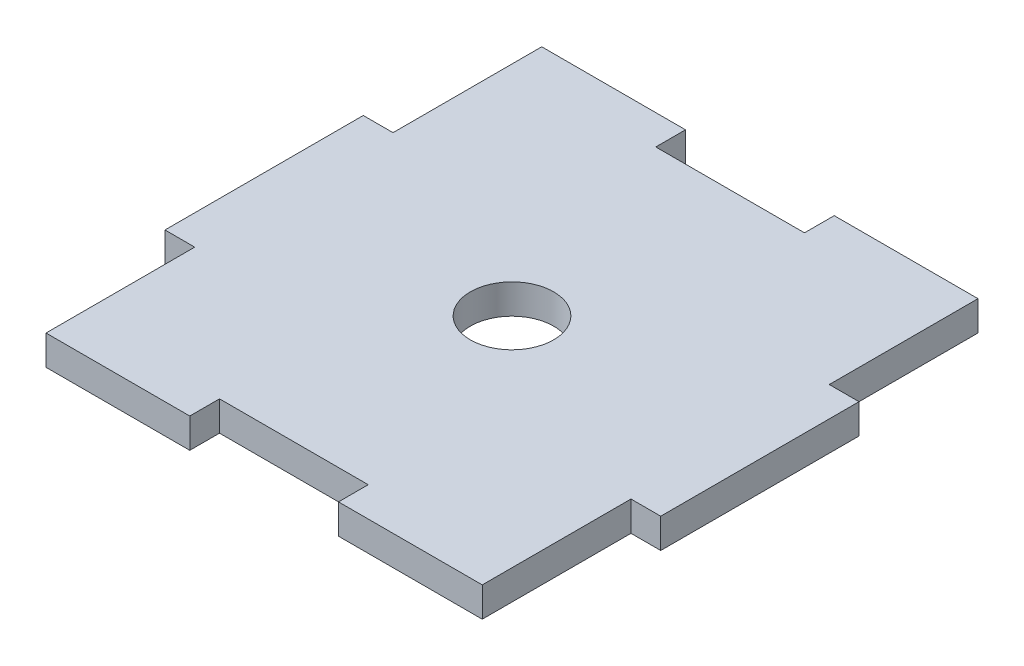
ISO-10303-21;
HEADER;
FILE_DESCRIPTION(('STEP AP214'),'2;1');
FILE_NAME('part.step','',(''),(''),'','','');
FILE_SCHEMA(('AUTOMOTIVE_DESIGN { 1 0 10303 214 1 1 1 1 }'));
ENDSEC;
DATA;
#1=APPLICATION_CONTEXT('core data for automotive mechanical design processes');
#2=APPLICATION_PROTOCOL_DEFINITION('international standard','automotive_design',2000,#1);
#3=PRODUCT_CONTEXT('',#1,'mechanical');
#4=PRODUCT('Part','Part','',(#3));
#5=PRODUCT_RELATED_PRODUCT_CATEGORY('part','',(#4));
#6=PRODUCT_DEFINITION_FORMATION('','',#4);
#7=PRODUCT_DEFINITION_CONTEXT('part definition',#1,'design');
#8=PRODUCT_DEFINITION('design','',#6,#7);
#9=PRODUCT_DEFINITION_SHAPE('','',#8);
#10=(LENGTH_UNIT() NAMED_UNIT(*) SI_UNIT(.MILLI.,.METRE.));
#11=(NAMED_UNIT(*) PLANE_ANGLE_UNIT() SI_UNIT($,.RADIAN.));
#12=(NAMED_UNIT(*) SI_UNIT($,.STERADIAN.) SOLID_ANGLE_UNIT());
#13=UNCERTAINTY_MEASURE_WITH_UNIT(LENGTH_MEASURE(1.E-05),#10,'distance_accuracy_value','');
#14=(GEOMETRIC_REPRESENTATION_CONTEXT(3) GLOBAL_UNCERTAINTY_ASSIGNED_CONTEXT((#13)) GLOBAL_UNIT_ASSIGNED_CONTEXT((#10,
#11,#12)) REPRESENTATION_CONTEXT('',''));
#15=CARTESIAN_POINT('',(0.,0.,0.));
#16=DIRECTION('',(0.,0.,1.));
#17=DIRECTION('',(1.,0.,0.));
#18=AXIS2_PLACEMENT_3D('',#15,#16,#17);
#19=CARTESIAN_POINT('',(0.,3.,0.));
#20=DIRECTION('',(0.,1.,0.));
#21=DIRECTION('',(0.,0.,1.));
#22=AXIS2_PLACEMENT_3D('',#19,#20,#21);
#23=PLANE('',#22);
#24=DIRECTION('',(-1.,0.,0.));
#25=VECTOR('',#24,1.);
#26=CARTESIAN_POINT('',(22.,3.,-25.));
#27=LINE('',#26,#25);
#28=CARTESIAN_POINT('',(22.,3.,-25.));
#29=VERTEX_POINT('',#28);
#30=CARTESIAN_POINT('',(7.5,3.,-25.));
#31=VERTEX_POINT('',#30);
#32=EDGE_CURVE('E243',#29,#31,#27,.T.);
#33=ORIENTED_EDGE('',*,*,#32,.T.);
#34=DIRECTION('',(0.,0.,1.));
#35=VECTOR('',#34,1.);
#36=CARTESIAN_POINT('',(7.5,3.,-25.));
#37=LINE('',#36,#35);
#38=CARTESIAN_POINT('',(7.5,3.,-22.));
#39=VERTEX_POINT('',#38);
#40=EDGE_CURVE('E131',#31,#39,#37,.T.);
#41=ORIENTED_EDGE('',*,*,#40,.T.);
#42=DIRECTION('',(-1.,0.,0.));
#43=VECTOR('',#42,1.);
#44=CARTESIAN_POINT('',(7.5,3.,-22.));
#45=LINE('',#44,#43);
#46=CARTESIAN_POINT('',(-7.5,3.,-22.));
#47=VERTEX_POINT('',#46);
#48=EDGE_CURVE('E294',#39,#47,#45,.T.);
#49=ORIENTED_EDGE('',*,*,#48,.T.);
#50=DIRECTION('',(0.,0.,-1.));
#51=VECTOR('',#50,1.);
#52=CARTESIAN_POINT('',(-7.5,3.,-25.));
#53=LINE('',#52,#51);
#54=CARTESIAN_POINT('',(-7.5,3.,-25.));
#55=VERTEX_POINT('',#54);
#56=EDGE_CURVE('E313',#47,#55,#53,.T.);
#57=ORIENTED_EDGE('',*,*,#56,.T.);
#58=DIRECTION('',(-1.,0.,0.));
#59=VECTOR('',#58,1.);
#60=CARTESIAN_POINT('',(-22.,3.,-25.));
#61=LINE('',#60,#59);
#62=CARTESIAN_POINT('',(-22.,3.,-25.));
#63=VERTEX_POINT('',#62);
#64=EDGE_CURVE('E310',#55,#63,#61,.T.);
#65=ORIENTED_EDGE('',*,*,#64,.T.);
#66=DIRECTION('',(0.,0.,1.));
#67=VECTOR('',#66,1.);
#68=CARTESIAN_POINT('',(-22.,3.,-25.));
#69=LINE('',#68,#67);
#70=CARTESIAN_POINT('',(-22.,3.,-10.));
#71=VERTEX_POINT('',#70);
#72=EDGE_CURVE('E312',#63,#71,#69,.T.);
#73=ORIENTED_EDGE('',*,*,#72,.T.);
#74=DIRECTION('',(-1.,0.,0.));
#75=VECTOR('',#74,1.);
#76=CARTESIAN_POINT('',(-22.,3.,-10.));
#77=LINE('',#76,#75);
#78=CARTESIAN_POINT('',(-25.,3.,-9.99999999999999));
#79=VERTEX_POINT('',#78);
#80=EDGE_CURVE('E315',#71,#79,#77,.T.);
#81=ORIENTED_EDGE('',*,*,#80,.T.);
#82=DIRECTION('',(0.,0.,1.));
#83=VECTOR('',#82,1.);
#84=CARTESIAN_POINT('',(-25.,3.,-9.99999999999999));
#85=LINE('',#84,#83);
#86=CARTESIAN_POINT('',(-25.,3.,9.99999999999999));
#87=VERTEX_POINT('',#86);
#88=EDGE_CURVE('E321',#79,#87,#85,.T.);
#89=ORIENTED_EDGE('',*,*,#88,.T.);
#90=DIRECTION('',(1.,0.,0.));
#91=VECTOR('',#90,1.);
#92=CARTESIAN_POINT('',(-22.,3.,10.));
#93=LINE('',#92,#91);
#94=CARTESIAN_POINT('',(-22.,3.,10.));
#95=VERTEX_POINT('',#94);
#96=EDGE_CURVE('E323',#87,#95,#93,.T.);
#97=ORIENTED_EDGE('',*,*,#96,.T.);
#98=DIRECTION('',(0.,0.,1.));
#99=VECTOR('',#98,1.);
#100=CARTESIAN_POINT('',(-22.,3.,25.));
#101=LINE('',#100,#99);
#102=CARTESIAN_POINT('',(-22.,3.,25.));
#103=VERTEX_POINT('',#102);
#104=EDGE_CURVE('E325',#95,#103,#101,.T.);
#105=ORIENTED_EDGE('',*,*,#104,.T.);
#106=DIRECTION('',(1.,0.,0.));
#107=VECTOR('',#106,1.);
#108=CARTESIAN_POINT('',(-22.,3.,25.));
#109=LINE('',#108,#107);
#110=CARTESIAN_POINT('',(-7.5,3.,25.));
#111=VERTEX_POINT('',#110);
#112=EDGE_CURVE('E327',#103,#111,#109,.T.);
#113=ORIENTED_EDGE('',*,*,#112,.T.);
#114=DIRECTION('',(0.,0.,-1.));
#115=VECTOR('',#114,1.);
#116=CARTESIAN_POINT('',(-7.5,3.,25.));
#117=LINE('',#116,#115);
#118=CARTESIAN_POINT('',(-7.5,3.,22.));
#119=VERTEX_POINT('',#118);
#120=EDGE_CURVE('E329',#111,#119,#117,.T.);
#121=ORIENTED_EDGE('',*,*,#120,.T.);
#122=DIRECTION('',(1.,0.,0.));
#123=VECTOR('',#122,1.);
#124=CARTESIAN_POINT('',(7.5,3.,22.));
#125=LINE('',#124,#123);
#126=CARTESIAN_POINT('',(7.5,3.,22.));
#127=VERTEX_POINT('',#126);
#128=EDGE_CURVE('E331',#119,#127,#125,.T.);
#129=ORIENTED_EDGE('',*,*,#128,.T.);
#130=DIRECTION('',(0.,0.,1.));
#131=VECTOR('',#130,1.);
#132=CARTESIAN_POINT('',(7.5,3.,25.));
#133=LINE('',#132,#131);
#134=CARTESIAN_POINT('',(7.5,3.,25.));
#135=VERTEX_POINT('',#134);
#136=EDGE_CURVE('E333',#127,#135,#133,.T.);
#137=ORIENTED_EDGE('',*,*,#136,.T.);
#138=DIRECTION('',(1.,0.,0.));
#139=VECTOR('',#138,1.);
#140=CARTESIAN_POINT('',(22.,3.,25.));
#141=LINE('',#140,#139);
#142=CARTESIAN_POINT('',(22.,3.,25.));
#143=VERTEX_POINT('',#142);
#144=EDGE_CURVE('E335',#135,#143,#141,.T.);
#145=ORIENTED_EDGE('',*,*,#144,.T.);
#146=DIRECTION('',(0.,0.,-1.));
#147=VECTOR('',#146,1.);
#148=CARTESIAN_POINT('',(22.,3.,25.));
#149=LINE('',#148,#147);
#150=CARTESIAN_POINT('',(22.,3.,10.));
#151=VERTEX_POINT('',#150);
#152=EDGE_CURVE('E337',#143,#151,#149,.T.);
#153=ORIENTED_EDGE('',*,*,#152,.T.);
#154=DIRECTION('',(1.,0.,0.));
#155=VECTOR('',#154,1.);
#156=CARTESIAN_POINT('',(22.,3.,10.));
#157=LINE('',#156,#155);
#158=CARTESIAN_POINT('',(25.,3.,9.99999999999999));
#159=VERTEX_POINT('',#158);
#160=EDGE_CURVE('E186',#151,#159,#157,.T.);
#161=ORIENTED_EDGE('',*,*,#160,.T.);
#162=DIRECTION('',(0.,0.,-1.));
#163=VECTOR('',#162,1.);
#164=CARTESIAN_POINT('',(25.,3.,-9.99999999999999));
#165=LINE('',#164,#163);
#166=CARTESIAN_POINT('',(25.,3.,-9.99999999999999));
#167=VERTEX_POINT('',#166);
#168=EDGE_CURVE('E180',#159,#167,#165,.T.);
#169=ORIENTED_EDGE('',*,*,#168,.T.);
#170=DIRECTION('',(-1.,0.,0.));
#171=VECTOR('',#170,1.);
#172=CARTESIAN_POINT('',(22.,3.,-10.));
#173=LINE('',#172,#171);
#174=CARTESIAN_POINT('',(22.,3.,-10.));
#175=VERTEX_POINT('',#174);
#176=EDGE_CURVE('E184',#167,#175,#173,.T.);
#177=ORIENTED_EDGE('',*,*,#176,.T.);
#178=DIRECTION('',(0.,0.,-1.));
#179=VECTOR('',#178,1.);
#180=CARTESIAN_POINT('',(22.,3.,-25.));
#181=LINE('',#180,#179);
#182=EDGE_CURVE('E52',#175,#29,#181,.T.);
#183=ORIENTED_EDGE('',*,*,#182,.T.);
#184=EDGE_LOOP('',(#33,#41,#49,#57,#65,#73,#81,#89,#97,#105,#113,#121,#129,#137,#145,#153,#161,
#169,#177,#183));
#185=FACE_BOUND('',#184,.T.);
#186=CARTESIAN_POINT('',(0.,3.,0.));
#187=DIRECTION('',(0.,1.,0.));
#188=DIRECTION('',(0.,0.,1.));
#189=AXIS2_PLACEMENT_3D('',#186,#187,#188);
#190=CIRCLE('',#189,4.2);
#191=CARTESIAN_POINT('',(0.,3.,4.2));
#192=VERTEX_POINT('',#191);
#193=EDGE_CURVE('E208',#192,#192,#190,.T.);
#194=ORIENTED_EDGE('',*,*,#193,.F.);
#195=EDGE_LOOP('',(#194));
#196=FACE_BOUND('',#195,.T.);
#197=ADVANCED_FACE('F35',(#185,#196),#23,.T.);
#198=CARTESIAN_POINT('',(0.,0.,0.));
#199=DIRECTION('',(0.,1.,0.));
#200=DIRECTION('',(0.,0.,1.));
#201=AXIS2_PLACEMENT_3D('',#198,#199,#200);
#202=PLANE('',#201);
#203=DIRECTION('',(-1.,0.,0.));
#204=VECTOR('',#203,1.);
#205=CARTESIAN_POINT('',(22.,0.,-25.));
#206=LINE('',#205,#204);
#207=CARTESIAN_POINT('',(22.,0.,-25.));
#208=VERTEX_POINT('',#207);
#209=CARTESIAN_POINT('',(7.5,0.,-25.));
#210=VERTEX_POINT('',#209);
#211=EDGE_CURVE('E204',#208,#210,#206,.T.);
#212=ORIENTED_EDGE('',*,*,#211,.F.);
#213=DIRECTION('',(0.,0.,-1.));
#214=VECTOR('',#213,1.);
#215=CARTESIAN_POINT('',(22.,0.,-25.));
#216=LINE('',#215,#214);
#217=CARTESIAN_POINT('',(22.,0.,-10.));
#218=VERTEX_POINT('',#217);
#219=EDGE_CURVE('E123',#218,#208,#216,.T.);
#220=ORIENTED_EDGE('',*,*,#219,.F.);
#221=DIRECTION('',(-1.,0.,0.));
#222=VECTOR('',#221,1.);
#223=CARTESIAN_POINT('',(22.,0.,-10.));
#224=LINE('',#223,#222);
#225=CARTESIAN_POINT('',(25.,0.,-9.99999999999999));
#226=VERTEX_POINT('',#225);
#227=EDGE_CURVE('E117',#226,#218,#224,.T.);
#228=ORIENTED_EDGE('',*,*,#227,.F.);
#229=DIRECTION('',(0.,0.,-1.));
#230=VECTOR('',#229,1.);
#231=CARTESIAN_POINT('',(25.,0.,-9.99999999999999));
#232=LINE('',#231,#230);
#233=CARTESIAN_POINT('',(25.,0.,9.99999999999999));
#234=VERTEX_POINT('',#233);
#235=EDGE_CURVE('E194',#234,#226,#232,.T.);
#236=ORIENTED_EDGE('',*,*,#235,.F.);
#237=DIRECTION('',(1.,0.,0.));
#238=VECTOR('',#237,1.);
#239=CARTESIAN_POINT('',(22.,0.,10.));
#240=LINE('',#239,#238);
#241=CARTESIAN_POINT('',(22.,0.,10.));
#242=VERTEX_POINT('',#241);
#243=EDGE_CURVE('E238',#242,#234,#240,.T.);
#244=ORIENTED_EDGE('',*,*,#243,.F.);
#245=DIRECTION('',(0.,0.,-1.));
#246=VECTOR('',#245,1.);
#247=CARTESIAN_POINT('',(22.,0.,25.));
#248=LINE('',#247,#246);
#249=CARTESIAN_POINT('',(22.,0.,25.));
#250=VERTEX_POINT('',#249);
#251=EDGE_CURVE('E236',#250,#242,#248,.T.);
#252=ORIENTED_EDGE('',*,*,#251,.F.);
#253=DIRECTION('',(1.,0.,0.));
#254=VECTOR('',#253,1.);
#255=CARTESIAN_POINT('',(22.,0.,25.));
#256=LINE('',#255,#254);
#257=CARTESIAN_POINT('',(7.5,0.,25.));
#258=VERTEX_POINT('',#257);
#259=EDGE_CURVE('E234',#258,#250,#256,.T.);
#260=ORIENTED_EDGE('',*,*,#259,.F.);
#261=DIRECTION('',(0.,0.,1.));
#262=VECTOR('',#261,1.);
#263=CARTESIAN_POINT('',(7.5,0.,25.));
#264=LINE('',#263,#262);
#265=CARTESIAN_POINT('',(7.5,0.,22.));
#266=VERTEX_POINT('',#265);
#267=EDGE_CURVE('E232',#266,#258,#264,.T.);
#268=ORIENTED_EDGE('',*,*,#267,.F.);
#269=DIRECTION('',(1.,0.,0.));
#270=VECTOR('',#269,1.);
#271=CARTESIAN_POINT('',(7.5,0.,22.));
#272=LINE('',#271,#270);
#273=CARTESIAN_POINT('',(-7.5,0.,22.));
#274=VERTEX_POINT('',#273);
#275=EDGE_CURVE('E230',#274,#266,#272,.T.);
#276=ORIENTED_EDGE('',*,*,#275,.F.);
#277=DIRECTION('',(0.,0.,-1.));
#278=VECTOR('',#277,1.);
#279=CARTESIAN_POINT('',(-7.5,0.,25.));
#280=LINE('',#279,#278);
#281=CARTESIAN_POINT('',(-7.5,0.,25.));
#282=VERTEX_POINT('',#281);
#283=EDGE_CURVE('E228',#282,#274,#280,.T.);
#284=ORIENTED_EDGE('',*,*,#283,.F.);
#285=DIRECTION('',(1.,0.,0.));
#286=VECTOR('',#285,1.);
#287=CARTESIAN_POINT('',(-22.,0.,25.));
#288=LINE('',#287,#286);
#289=CARTESIAN_POINT('',(-22.,0.,25.));
#290=VERTEX_POINT('',#289);
#291=EDGE_CURVE('E226',#290,#282,#288,.T.);
#292=ORIENTED_EDGE('',*,*,#291,.F.);
#293=DIRECTION('',(0.,0.,1.));
#294=VECTOR('',#293,1.);
#295=CARTESIAN_POINT('',(-22.,0.,25.));
#296=LINE('',#295,#294);
#297=CARTESIAN_POINT('',(-22.,0.,10.));
#298=VERTEX_POINT('',#297);
#299=EDGE_CURVE('E224',#298,#290,#296,.T.);
#300=ORIENTED_EDGE('',*,*,#299,.F.);
#301=DIRECTION('',(1.,0.,0.));
#302=VECTOR('',#301,1.);
#303=CARTESIAN_POINT('',(-22.,0.,10.));
#304=LINE('',#303,#302);
#305=CARTESIAN_POINT('',(-25.,0.,9.99999999999999));
#306=VERTEX_POINT('',#305);
#307=EDGE_CURVE('E222',#306,#298,#304,.T.);
#308=ORIENTED_EDGE('',*,*,#307,.F.);
#309=DIRECTION('',(0.,0.,1.));
#310=VECTOR('',#309,1.);
#311=CARTESIAN_POINT('',(-25.,0.,-9.99999999999999));
#312=LINE('',#311,#310);
#313=CARTESIAN_POINT('',(-25.,0.,-9.99999999999999));
#314=VERTEX_POINT('',#313);
#315=EDGE_CURVE('E220',#314,#306,#312,.T.);
#316=ORIENTED_EDGE('',*,*,#315,.F.);
#317=DIRECTION('',(-1.,0.,0.));
#318=VECTOR('',#317,1.);
#319=CARTESIAN_POINT('',(-22.,0.,-10.));
#320=LINE('',#319,#318);
#321=CARTESIAN_POINT('',(-22.,0.,-10.));
#322=VERTEX_POINT('',#321);
#323=EDGE_CURVE('E218',#322,#314,#320,.T.);
#324=ORIENTED_EDGE('',*,*,#323,.F.);
#325=DIRECTION('',(0.,0.,1.));
#326=VECTOR('',#325,1.);
#327=CARTESIAN_POINT('',(-22.,0.,-25.));
#328=LINE('',#327,#326);
#329=CARTESIAN_POINT('',(-22.,0.,-25.));
#330=VERTEX_POINT('',#329);
#331=EDGE_CURVE('E216',#330,#322,#328,.T.);
#332=ORIENTED_EDGE('',*,*,#331,.F.);
#333=DIRECTION('',(-1.,0.,0.));
#334=VECTOR('',#333,1.);
#335=CARTESIAN_POINT('',(-22.,0.,-25.));
#336=LINE('',#335,#334);
#337=CARTESIAN_POINT('',(-7.5,0.,-25.));
#338=VERTEX_POINT('',#337);
#339=EDGE_CURVE('E214',#338,#330,#336,.T.);
#340=ORIENTED_EDGE('',*,*,#339,.F.);
#341=DIRECTION('',(0.,0.,-1.));
#342=VECTOR('',#341,1.);
#343=CARTESIAN_POINT('',(-7.5,0.,-25.));
#344=LINE('',#343,#342);
#345=CARTESIAN_POINT('',(-7.5,0.,-22.));
#346=VERTEX_POINT('',#345);
#347=EDGE_CURVE('E212',#346,#338,#344,.T.);
#348=ORIENTED_EDGE('',*,*,#347,.F.);
#349=DIRECTION('',(-1.,0.,0.));
#350=VECTOR('',#349,1.);
#351=CARTESIAN_POINT('',(7.5,0.,-22.));
#352=LINE('',#351,#350);
#353=CARTESIAN_POINT('',(7.5,0.,-22.));
#354=VERTEX_POINT('',#353);
#355=EDGE_CURVE('E210',#354,#346,#352,.T.);
#356=ORIENTED_EDGE('',*,*,#355,.F.);
#357=DIRECTION('',(0.,0.,1.));
#358=VECTOR('',#357,1.);
#359=CARTESIAN_POINT('',(7.5,0.,-25.));
#360=LINE('',#359,#358);
#361=EDGE_CURVE('E207',#210,#354,#360,.T.);
#362=ORIENTED_EDGE('',*,*,#361,.F.);
#363=EDGE_LOOP('',(#212,#220,#228,#236,#244,#252,#260,#268,#276,#284,#292,#300,#308,#316,#324,
#332,#340,#348,#356,#362));
#364=FACE_BOUND('',#363,.T.);
#365=CARTESIAN_POINT('',(0.,0.,0.));
#366=DIRECTION('',(0.,1.,0.));
#367=DIRECTION('',(0.,0.,1.));
#368=AXIS2_PLACEMENT_3D('',#365,#366,#367);
#369=CIRCLE('',#368,4.2);
#370=CARTESIAN_POINT('',(0.,0.,4.2));
#371=VERTEX_POINT('',#370);
#372=EDGE_CURVE('E588',#371,#371,#369,.T.);
#373=ORIENTED_EDGE('',*,*,#372,.T.);
#374=EDGE_LOOP('',(#373));
#375=FACE_BOUND('',#374,.T.);
#376=ADVANCED_FACE('F298',(#364,#375),#202,.F.);
#377=CARTESIAN_POINT('',(22.,3.,-25.));
#378=DIRECTION('',(0.,0.,1.));
#379=DIRECTION('',(1.,0.,0.));
#380=AXIS2_PLACEMENT_3D('',#377,#378,#379);
#381=PLANE('',#380);
#382=ORIENTED_EDGE('',*,*,#211,.T.);
#383=DIRECTION('',(0.,-1.,0.));
#384=VECTOR('',#383,1.);
#385=CARTESIAN_POINT('',(7.5,3.,-25.));
#386=LINE('',#385,#384);
#387=EDGE_CURVE('E11',#31,#210,#386,.T.);
#388=ORIENTED_EDGE('',*,*,#387,.F.);
#389=ORIENTED_EDGE('',*,*,#32,.F.);
#390=DIRECTION('',(0.,-1.,0.));
#391=VECTOR('',#390,1.);
#392=CARTESIAN_POINT('',(22.,3.,-25.));
#393=LINE('',#392,#391);
#394=EDGE_CURVE('E200',#29,#208,#393,.T.);
#395=ORIENTED_EDGE('',*,*,#394,.T.);
#396=EDGE_LOOP('',(#382,#388,#389,#395));
#397=FACE_BOUND('',#396,.T.);
#398=ADVANCED_FACE('F37',(#397),#381,.F.);
#399=CARTESIAN_POINT('',(7.5,3.,-25.));
#400=DIRECTION('',(1.,0.,0.));
#401=DIRECTION('',(0.,0.,-1.));
#402=AXIS2_PLACEMENT_3D('',#399,#400,#401);
#403=PLANE('',#402);
#404=ORIENTED_EDGE('',*,*,#361,.T.);
#405=DIRECTION('',(0.,-1.,0.));
#406=VECTOR('',#405,1.);
#407=CARTESIAN_POINT('',(7.5,3.,-22.));
#408=LINE('',#407,#406);
#409=EDGE_CURVE('E44',#39,#354,#408,.T.);
#410=ORIENTED_EDGE('',*,*,#409,.F.);
#411=ORIENTED_EDGE('',*,*,#40,.F.);
#412=ORIENTED_EDGE('',*,*,#387,.T.);
#413=EDGE_LOOP('',(#404,#410,#411,#412));
#414=FACE_BOUND('',#413,.T.);
#415=ADVANCED_FACE('F371',(#414),#403,.F.);
#416=CARTESIAN_POINT('',(7.5,3.,-22.));
#417=DIRECTION('',(0.,0.,1.));
#418=DIRECTION('',(1.,0.,0.));
#419=AXIS2_PLACEMENT_3D('',#416,#417,#418);
#420=PLANE('',#419);
#421=ORIENTED_EDGE('',*,*,#355,.T.);
#422=DIRECTION('',(0.,-1.,0.));
#423=VECTOR('',#422,1.);
#424=CARTESIAN_POINT('',(-7.5,3.,-22.));
#425=LINE('',#424,#423);
#426=EDGE_CURVE('E286',#47,#346,#425,.T.);
#427=ORIENTED_EDGE('',*,*,#426,.F.);
#428=ORIENTED_EDGE('',*,*,#48,.F.);
#429=ORIENTED_EDGE('',*,*,#409,.T.);
#430=EDGE_LOOP('',(#421,#427,#428,#429));
#431=FACE_BOUND('',#430,.T.);
#432=ADVANCED_FACE('F292',(#431),#420,.F.);
#433=CARTESIAN_POINT('',(-7.5,3.,-25.));
#434=DIRECTION('',(-1.,0.,0.));
#435=DIRECTION('',(0.,0.,1.));
#436=AXIS2_PLACEMENT_3D('',#433,#434,#435);
#437=PLANE('',#436);
#438=ORIENTED_EDGE('',*,*,#347,.T.);
#439=DIRECTION('',(0.,-1.,0.));
#440=VECTOR('',#439,1.);
#441=CARTESIAN_POINT('',(-7.5,3.,-25.));
#442=LINE('',#441,#440);
#443=EDGE_CURVE('E283',#55,#338,#442,.T.);
#444=ORIENTED_EDGE('',*,*,#443,.F.);
#445=ORIENTED_EDGE('',*,*,#56,.F.);
#446=ORIENTED_EDGE('',*,*,#426,.T.);
#447=EDGE_LOOP('',(#438,#444,#445,#446));
#448=FACE_BOUND('',#447,.T.);
#449=ADVANCED_FACE('F304',(#448),#437,.F.);
#450=CARTESIAN_POINT('',(-22.,3.,-25.));
#451=DIRECTION('',(0.,0.,1.));
#452=DIRECTION('',(1.,0.,0.));
#453=AXIS2_PLACEMENT_3D('',#450,#451,#452);
#454=PLANE('',#453);
#455=ORIENTED_EDGE('',*,*,#339,.T.);
#456=DIRECTION('',(0.,-1.,0.));
#457=VECTOR('',#456,1.);
#458=CARTESIAN_POINT('',(-22.,3.,-25.));
#459=LINE('',#458,#457);
#460=EDGE_CURVE('E280',#63,#330,#459,.T.);
#461=ORIENTED_EDGE('',*,*,#460,.F.);
#462=ORIENTED_EDGE('',*,*,#64,.F.);
#463=ORIENTED_EDGE('',*,*,#443,.T.);
#464=EDGE_LOOP('',(#455,#461,#462,#463));
#465=FACE_BOUND('',#464,.T.);
#466=ADVANCED_FACE('F308',(#465),#454,.F.);
#467=CARTESIAN_POINT('',(-22.,3.,-25.));
#468=DIRECTION('',(1.,0.,0.));
#469=DIRECTION('',(0.,0.,-1.));
#470=AXIS2_PLACEMENT_3D('',#467,#468,#469);
#471=PLANE('',#470);
#472=ORIENTED_EDGE('',*,*,#331,.T.);
#473=DIRECTION('',(0.,-1.,0.));
#474=VECTOR('',#473,1.);
#475=CARTESIAN_POINT('',(-22.,3.,-10.));
#476=LINE('',#475,#474);
#477=EDGE_CURVE('E277',#71,#322,#476,.T.);
#478=ORIENTED_EDGE('',*,*,#477,.F.);
#479=ORIENTED_EDGE('',*,*,#72,.F.);
#480=ORIENTED_EDGE('',*,*,#460,.T.);
#481=EDGE_LOOP('',(#472,#478,#479,#480));
#482=FACE_BOUND('',#481,.T.);
#483=ADVANCED_FACE('F384',(#482),#471,.F.);
#484=CARTESIAN_POINT('',(-22.,3.,-10.));
#485=DIRECTION('',(0.,0.,1.));
#486=DIRECTION('',(1.,0.,0.));
#487=AXIS2_PLACEMENT_3D('',#484,#485,#486);
#488=PLANE('',#487);
#489=ORIENTED_EDGE('',*,*,#323,.T.);
#490=DIRECTION('',(0.,-1.,0.));
#491=VECTOR('',#490,1.);
#492=CARTESIAN_POINT('',(-25.,3.,-9.99999999999999));
#493=LINE('',#492,#491);
#494=EDGE_CURVE('E274',#79,#314,#493,.T.);
#495=ORIENTED_EDGE('',*,*,#494,.F.);
#496=ORIENTED_EDGE('',*,*,#80,.F.);
#497=ORIENTED_EDGE('',*,*,#477,.T.);
#498=EDGE_LOOP('',(#489,#495,#496,#497));
#499=FACE_BOUND('',#498,.T.);
#500=ADVANCED_FACE('F387',(#499),#488,.F.);
#501=CARTESIAN_POINT('',(-25.,3.,-9.99999999999999));
#502=DIRECTION('',(1.,0.,0.));
#503=DIRECTION('',(0.,0.,-1.));
#504=AXIS2_PLACEMENT_3D('',#501,#502,#503);
#505=PLANE('',#504);
#506=ORIENTED_EDGE('',*,*,#315,.T.);
#507=DIRECTION('',(0.,-1.,0.));
#508=VECTOR('',#507,1.);
#509=CARTESIAN_POINT('',(-25.,3.,9.99999999999999));
#510=LINE('',#509,#508);
#511=EDGE_CURVE('E271',#87,#306,#510,.T.);
#512=ORIENTED_EDGE('',*,*,#511,.F.);
#513=ORIENTED_EDGE('',*,*,#88,.F.);
#514=ORIENTED_EDGE('',*,*,#494,.T.);
#515=EDGE_LOOP('',(#506,#512,#513,#514));
#516=FACE_BOUND('',#515,.T.);
#517=ADVANCED_FACE('F391',(#516),#505,.F.);
#518=CARTESIAN_POINT('',(-22.,3.,10.));
#519=DIRECTION('',(0.,0.,-1.));
#520=DIRECTION('',(-1.,0.,0.));
#521=AXIS2_PLACEMENT_3D('',#518,#519,#520);
#522=PLANE('',#521);
#523=ORIENTED_EDGE('',*,*,#307,.T.);
#524=DIRECTION('',(0.,-1.,0.));
#525=VECTOR('',#524,1.);
#526=CARTESIAN_POINT('',(-22.,3.,10.));
#527=LINE('',#526,#525);
#528=EDGE_CURVE('E268',#95,#298,#527,.T.);
#529=ORIENTED_EDGE('',*,*,#528,.F.);
#530=ORIENTED_EDGE('',*,*,#96,.F.);
#531=ORIENTED_EDGE('',*,*,#511,.T.);
#532=EDGE_LOOP('',(#523,#529,#530,#531));
#533=FACE_BOUND('',#532,.T.);
#534=ADVANCED_FACE('F395',(#533),#522,.F.);
#535=CARTESIAN_POINT('',(-22.,3.,25.));
#536=DIRECTION('',(1.,0.,0.));
#537=DIRECTION('',(0.,0.,-1.));
#538=AXIS2_PLACEMENT_3D('',#535,#536,#537);
#539=PLANE('',#538);
#540=ORIENTED_EDGE('',*,*,#299,.T.);
#541=DIRECTION('',(0.,-1.,0.));
#542=VECTOR('',#541,1.);
#543=CARTESIAN_POINT('',(-22.,3.,25.));
#544=LINE('',#543,#542);
#545=EDGE_CURVE('E265',#103,#290,#544,.T.);
#546=ORIENTED_EDGE('',*,*,#545,.F.);
#547=ORIENTED_EDGE('',*,*,#104,.F.);
#548=ORIENTED_EDGE('',*,*,#528,.T.);
#549=EDGE_LOOP('',(#540,#546,#547,#548));
#550=FACE_BOUND('',#549,.T.);
#551=ADVANCED_FACE('F399',(#550),#539,.F.);
#552=CARTESIAN_POINT('',(-22.,3.,25.));
#553=DIRECTION('',(0.,0.,-1.));
#554=DIRECTION('',(-1.,0.,0.));
#555=AXIS2_PLACEMENT_3D('',#552,#553,#554);
#556=PLANE('',#555);
#557=ORIENTED_EDGE('',*,*,#291,.T.);
#558=DIRECTION('',(0.,-1.,0.));
#559=VECTOR('',#558,1.);
#560=CARTESIAN_POINT('',(-7.5,3.,25.));
#561=LINE('',#560,#559);
#562=EDGE_CURVE('E262',#111,#282,#561,.T.);
#563=ORIENTED_EDGE('',*,*,#562,.F.);
#564=ORIENTED_EDGE('',*,*,#112,.F.);
#565=ORIENTED_EDGE('',*,*,#545,.T.);
#566=EDGE_LOOP('',(#557,#563,#564,#565));
#567=FACE_BOUND('',#566,.T.);
#568=ADVANCED_FACE('F403',(#567),#556,.F.);
#569=CARTESIAN_POINT('',(-7.5,3.,25.));
#570=DIRECTION('',(-1.,0.,0.));
#571=DIRECTION('',(0.,0.,1.));
#572=AXIS2_PLACEMENT_3D('',#569,#570,#571);
#573=PLANE('',#572);
#574=ORIENTED_EDGE('',*,*,#283,.T.);
#575=DIRECTION('',(0.,-1.,0.));
#576=VECTOR('',#575,1.);
#577=CARTESIAN_POINT('',(-7.5,3.,22.));
#578=LINE('',#577,#576);
#579=EDGE_CURVE('E259',#119,#274,#578,.T.);
#580=ORIENTED_EDGE('',*,*,#579,.F.);
#581=ORIENTED_EDGE('',*,*,#120,.F.);
#582=ORIENTED_EDGE('',*,*,#562,.T.);
#583=EDGE_LOOP('',(#574,#580,#581,#582));
#584=FACE_BOUND('',#583,.T.);
#585=ADVANCED_FACE('F407',(#584),#573,.F.);
#586=CARTESIAN_POINT('',(7.5,3.,22.));
#587=DIRECTION('',(0.,0.,-1.));
#588=DIRECTION('',(-1.,0.,0.));
#589=AXIS2_PLACEMENT_3D('',#586,#587,#588);
#590=PLANE('',#589);
#591=ORIENTED_EDGE('',*,*,#275,.T.);
#592=DIRECTION('',(0.,-1.,0.));
#593=VECTOR('',#592,1.);
#594=CARTESIAN_POINT('',(7.5,3.,22.));
#595=LINE('',#594,#593);
#596=EDGE_CURVE('E256',#127,#266,#595,.T.);
#597=ORIENTED_EDGE('',*,*,#596,.F.);
#598=ORIENTED_EDGE('',*,*,#128,.F.);
#599=ORIENTED_EDGE('',*,*,#579,.T.);
#600=EDGE_LOOP('',(#591,#597,#598,#599));
#601=FACE_BOUND('',#600,.T.);
#602=ADVANCED_FACE('F411',(#601),#590,.F.);
#603=CARTESIAN_POINT('',(7.5,3.,25.));
#604=DIRECTION('',(1.,0.,0.));
#605=DIRECTION('',(0.,0.,-1.));
#606=AXIS2_PLACEMENT_3D('',#603,#604,#605);
#607=PLANE('',#606);
#608=ORIENTED_EDGE('',*,*,#267,.T.);
#609=DIRECTION('',(0.,-1.,0.));
#610=VECTOR('',#609,1.);
#611=CARTESIAN_POINT('',(7.5,3.,25.));
#612=LINE('',#611,#610);
#613=EDGE_CURVE('E253',#135,#258,#612,.T.);
#614=ORIENTED_EDGE('',*,*,#613,.F.);
#615=ORIENTED_EDGE('',*,*,#136,.F.);
#616=ORIENTED_EDGE('',*,*,#596,.T.);
#617=EDGE_LOOP('',(#608,#614,#615,#616));
#618=FACE_BOUND('',#617,.T.);
#619=ADVANCED_FACE('F415',(#618),#607,.F.);
#620=CARTESIAN_POINT('',(22.,3.,25.));
#621=DIRECTION('',(0.,0.,-1.));
#622=DIRECTION('',(-1.,0.,0.));
#623=AXIS2_PLACEMENT_3D('',#620,#621,#622);
#624=PLANE('',#623);
#625=ORIENTED_EDGE('',*,*,#259,.T.);
#626=DIRECTION('',(0.,-1.,0.));
#627=VECTOR('',#626,1.);
#628=CARTESIAN_POINT('',(22.,3.,25.));
#629=LINE('',#628,#627);
#630=EDGE_CURVE('E250',#143,#250,#629,.T.);
#631=ORIENTED_EDGE('',*,*,#630,.F.);
#632=ORIENTED_EDGE('',*,*,#144,.F.);
#633=ORIENTED_EDGE('',*,*,#613,.T.);
#634=EDGE_LOOP('',(#625,#631,#632,#633));
#635=FACE_BOUND('',#634,.T.);
#636=ADVANCED_FACE('F419',(#635),#624,.F.);
#637=CARTESIAN_POINT('',(22.,3.,25.));
#638=DIRECTION('',(-1.,0.,0.));
#639=DIRECTION('',(0.,0.,1.));
#640=AXIS2_PLACEMENT_3D('',#637,#638,#639);
#641=PLANE('',#640);
#642=ORIENTED_EDGE('',*,*,#251,.T.);
#643=DIRECTION('',(0.,-1.,0.));
#644=VECTOR('',#643,1.);
#645=CARTESIAN_POINT('',(22.,3.,10.));
#646=LINE('',#645,#644);
#647=EDGE_CURVE('E247',#151,#242,#646,.T.);
#648=ORIENTED_EDGE('',*,*,#647,.F.);
#649=ORIENTED_EDGE('',*,*,#152,.F.);
#650=ORIENTED_EDGE('',*,*,#630,.T.);
#651=EDGE_LOOP('',(#642,#648,#649,#650));
#652=FACE_BOUND('',#651,.T.);
#653=ADVANCED_FACE('F343',(#652),#641,.F.);
#654=CARTESIAN_POINT('',(22.,3.,10.));
#655=DIRECTION('',(0.,0.,-1.));
#656=DIRECTION('',(-1.,0.,0.));
#657=AXIS2_PLACEMENT_3D('',#654,#655,#656);
#658=PLANE('',#657);
#659=ORIENTED_EDGE('',*,*,#243,.T.);
#660=DIRECTION('',(0.,-1.,0.));
#661=VECTOR('',#660,1.);
#662=CARTESIAN_POINT('',(25.,3.,9.99999999999999));
#663=LINE('',#662,#661);
#664=EDGE_CURVE('E195',#159,#234,#663,.T.);
#665=ORIENTED_EDGE('',*,*,#664,.F.);
#666=ORIENTED_EDGE('',*,*,#160,.F.);
#667=ORIENTED_EDGE('',*,*,#647,.T.);
#668=EDGE_LOOP('',(#659,#665,#666,#667));
#669=FACE_BOUND('',#668,.T.);
#670=ADVANCED_FACE('F347',(#669),#658,.F.);
#671=CARTESIAN_POINT('',(25.,3.,-9.99999999999999));
#672=DIRECTION('',(-1.,0.,0.));
#673=DIRECTION('',(0.,0.,1.));
#674=AXIS2_PLACEMENT_3D('',#671,#672,#673);
#675=PLANE('',#674);
#676=ORIENTED_EDGE('',*,*,#235,.T.);
#677=DIRECTION('',(0.,-1.,0.));
#678=VECTOR('',#677,1.);
#679=CARTESIAN_POINT('',(25.,3.,-9.99999999999999));
#680=LINE('',#679,#678);
#681=EDGE_CURVE('E191',#167,#226,#680,.T.);
#682=ORIENTED_EDGE('',*,*,#681,.F.);
#683=ORIENTED_EDGE('',*,*,#168,.F.);
#684=ORIENTED_EDGE('',*,*,#664,.T.);
#685=EDGE_LOOP('',(#676,#682,#683,#684));
#686=FACE_BOUND('',#685,.T.);
#687=ADVANCED_FACE('F192',(#686),#675,.F.);
#688=CARTESIAN_POINT('',(22.,3.,-10.));
#689=DIRECTION('',(0.,0.,1.));
#690=DIRECTION('',(1.,0.,0.));
#691=AXIS2_PLACEMENT_3D('',#688,#689,#690);
#692=PLANE('',#691);
#693=ORIENTED_EDGE('',*,*,#227,.T.);
#694=DIRECTION('',(0.,-1.,0.));
#695=VECTOR('',#694,1.);
#696=CARTESIAN_POINT('',(22.,3.,-10.));
#697=LINE('',#696,#695);
#698=EDGE_CURVE('E196',#175,#218,#697,.T.);
#699=ORIENTED_EDGE('',*,*,#698,.F.);
#700=ORIENTED_EDGE('',*,*,#176,.F.);
#701=ORIENTED_EDGE('',*,*,#681,.T.);
#702=EDGE_LOOP('',(#693,#699,#700,#701));
#703=FACE_BOUND('',#702,.T.);
#704=ADVANCED_FACE('F198',(#703),#692,.F.);
#705=CARTESIAN_POINT('',(22.,3.,-25.));
#706=DIRECTION('',(-1.,0.,0.));
#707=DIRECTION('',(0.,0.,1.));
#708=AXIS2_PLACEMENT_3D('',#705,#706,#707);
#709=PLANE('',#708);
#710=ORIENTED_EDGE('',*,*,#219,.T.);
#711=ORIENTED_EDGE('',*,*,#394,.F.);
#712=ORIENTED_EDGE('',*,*,#182,.F.);
#713=ORIENTED_EDGE('',*,*,#698,.T.);
#714=EDGE_LOOP('',(#710,#711,#712,#713));
#715=FACE_BOUND('',#714,.T.);
#716=ADVANCED_FACE('F351',(#715),#709,.F.);
#717=CARTESIAN_POINT('',(0.,3.,0.));
#718=DIRECTION('',(0.,-1.,0.));
#719=DIRECTION('',(0.,0.,-1.));
#720=AXIS2_PLACEMENT_3D('',#717,#718,#719);
#721=CYLINDRICAL_SURFACE('',#720,4.2);
#722=ORIENTED_EDGE('',*,*,#193,.T.);
#723=EDGE_LOOP('',(#722));
#724=FACE_BOUND('',#723,.T.);
#725=ORIENTED_EDGE('',*,*,#372,.F.);
#726=EDGE_LOOP('',(#725));
#727=FACE_BOUND('',#726,.T.);
#728=ADVANCED_FACE('F353',(#724,#727),#721,.F.);
#729=CLOSED_SHELL('',(#197,#376,#398,#415,#432,#449,#466,#483,#500,#517,#534,#551,#568,#585,
#602,#619,#636,#653,#670,#687,#704,#716,#728));
#730=MANIFOLD_SOLID_BREP('B2',#729);
#731=ADVANCED_BREP_SHAPE_REPRESENTATION('',(#18,#730),#14);
#732=SHAPE_DEFINITION_REPRESENTATION(#9,#731);
ENDSEC;
END-ISO-10303-21;
